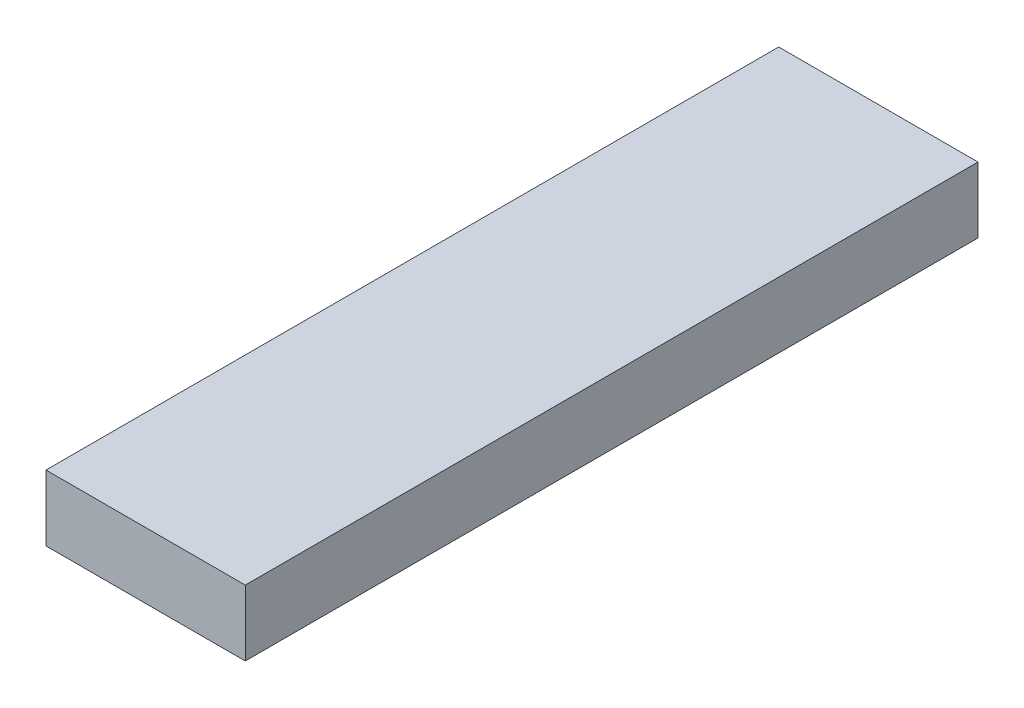
ISO-10303-21;
HEADER;
FILE_DESCRIPTION(('STEP AP214'),'2;1');
FILE_NAME('part.step','',(''),(''),'','','');
FILE_SCHEMA(('AUTOMOTIVE_DESIGN { 1 0 10303 214 1 1 1 1 }'));
ENDSEC;
DATA;
#1=APPLICATION_CONTEXT('core data for automotive mechanical design processes');
#2=APPLICATION_PROTOCOL_DEFINITION('international standard','automotive_design',2000,#1);
#3=PRODUCT_CONTEXT('',#1,'mechanical');
#4=PRODUCT('Part','Part','',(#3));
#5=PRODUCT_RELATED_PRODUCT_CATEGORY('part','',(#4));
#6=PRODUCT_DEFINITION_FORMATION('','',#4);
#7=PRODUCT_DEFINITION_CONTEXT('part definition',#1,'design');
#8=PRODUCT_DEFINITION('design','',#6,#7);
#9=PRODUCT_DEFINITION_SHAPE('','',#8);
#10=(LENGTH_UNIT() NAMED_UNIT(*) SI_UNIT(.MILLI.,.METRE.));
#11=(NAMED_UNIT(*) PLANE_ANGLE_UNIT() SI_UNIT($,.RADIAN.));
#12=(NAMED_UNIT(*) SI_UNIT($,.STERADIAN.) SOLID_ANGLE_UNIT());
#13=UNCERTAINTY_MEASURE_WITH_UNIT(LENGTH_MEASURE(1.E-05),#10,'distance_accuracy_value','');
#14=(GEOMETRIC_REPRESENTATION_CONTEXT(3) GLOBAL_UNCERTAINTY_ASSIGNED_CONTEXT((#13)) GLOBAL_UNIT_ASSIGNED_CONTEXT((#10,
#11,#12)) REPRESENTATION_CONTEXT('',''));
#15=CARTESIAN_POINT('',(0.,0.,0.));
#16=DIRECTION('',(0.,0.,1.));
#17=DIRECTION('',(1.,0.,0.));
#18=AXIS2_PLACEMENT_3D('',#15,#16,#17);
#19=CARTESIAN_POINT('',(-22.5209293511614,8.38199999999999,-44.2148189238903));
#20=DIRECTION('',(1.,0.,0.));
#21=DIRECTION('',(0.,0.,-1.));
#22=AXIS2_PLACEMENT_3D('',#19,#20,#21);
#23=PLANE('',#22);
#24=DIRECTION('',(0.,0.,1.));
#25=VECTOR('',#24,1.);
#26=CARTESIAN_POINT('',(-22.5209293511614,0.,-44.2148189238903));
#27=LINE('',#26,#25);
#28=CARTESIAN_POINT('',(-22.5209293511614,0.,-44.2148189238903));
#29=VERTEX_POINT('',#28);
#30=CARTESIAN_POINT('',(-22.5209293511614,0.,49.1770575944851));
#31=VERTEX_POINT('',#30);
#32=EDGE_CURVE('E109',#29,#31,#27,.T.);
#33=ORIENTED_EDGE('',*,*,#32,.T.);
#34=DIRECTION('',(0.,-1.,0.));
#35=VECTOR('',#34,1.);
#36=CARTESIAN_POINT('',(-22.5209293511614,8.38199999999999,49.1770575944851));
#37=LINE('',#36,#35);
#38=CARTESIAN_POINT('',(-22.5209293511614,8.38199999999999,49.1770575944851));
#39=VERTEX_POINT('',#38);
#40=EDGE_CURVE('E11',#39,#31,#37,.T.);
#41=ORIENTED_EDGE('',*,*,#40,.F.);
#42=DIRECTION('',(0.,0.,1.));
#43=VECTOR('',#42,1.);
#44=CARTESIAN_POINT('',(-22.5209293511614,8.38199999999999,-44.2148189238903));
#45=LINE('',#44,#43);
#46=CARTESIAN_POINT('',(-22.5209293511614,8.38199999999999,-44.2148189238903));
#47=VERTEX_POINT('',#46);
#48=EDGE_CURVE('E93',#47,#39,#45,.T.);
#49=ORIENTED_EDGE('',*,*,#48,.F.);
#50=DIRECTION('',(0.,-1.,0.));
#51=VECTOR('',#50,1.);
#52=CARTESIAN_POINT('',(-22.5209293511614,8.38199999999999,-44.2148189238903));
#53=LINE('',#52,#51);
#54=EDGE_CURVE('E105',#47,#29,#53,.T.);
#55=ORIENTED_EDGE('',*,*,#54,.T.);
#56=EDGE_LOOP('',(#33,#41,#49,#55));
#57=FACE_BOUND('',#56,.T.);
#58=ADVANCED_FACE('F41',(#57),#23,.F.);
#59=CARTESIAN_POINT('',(-22.5209293511614,8.38199999999999,49.1770575944851));
#60=DIRECTION('',(0.,0.,-1.));
#61=DIRECTION('',(-1.,0.,0.));
#62=AXIS2_PLACEMENT_3D('',#59,#60,#61);
#63=PLANE('',#62);
#64=DIRECTION('',(1.,0.,0.));
#65=VECTOR('',#64,1.);
#66=CARTESIAN_POINT('',(-22.5209293511614,0.,49.1770575944851));
#67=LINE('',#66,#65);
#68=CARTESIAN_POINT('',(2.87907064883863,0.,49.1770575944851));
#69=VERTEX_POINT('',#68);
#70=EDGE_CURVE('E98',#31,#69,#67,.T.);
#71=ORIENTED_EDGE('',*,*,#70,.T.);
#72=DIRECTION('',(0.,-1.,0.));
#73=VECTOR('',#72,1.);
#74=CARTESIAN_POINT('',(2.87907064883863,8.38199999999999,49.1770575944851));
#75=LINE('',#74,#73);
#76=CARTESIAN_POINT('',(2.87907064883863,8.38199999999999,49.1770575944851));
#77=VERTEX_POINT('',#76);
#78=EDGE_CURVE('E50',#77,#69,#75,.T.);
#79=ORIENTED_EDGE('',*,*,#78,.F.);
#80=DIRECTION('',(1.,0.,0.));
#81=VECTOR('',#80,1.);
#82=CARTESIAN_POINT('',(-22.5209293511614,8.38199999999999,49.1770575944851));
#83=LINE('',#82,#81);
#84=EDGE_CURVE('E88',#39,#77,#83,.T.);
#85=ORIENTED_EDGE('',*,*,#84,.F.);
#86=ORIENTED_EDGE('',*,*,#40,.T.);
#87=EDGE_LOOP('',(#71,#79,#85,#86));
#88=FACE_BOUND('',#87,.T.);
#89=ADVANCED_FACE('F97',(#88),#63,.F.);
#90=CARTESIAN_POINT('',(2.87907064883862,8.38199999999999,-44.2148189238903));
#91=DIRECTION('',(-1.,0.,0.));
#92=DIRECTION('',(0.,0.,1.));
#93=AXIS2_PLACEMENT_3D('',#90,#91,#92);
#94=PLANE('',#93);
#95=DIRECTION('',(0.,0.,-1.));
#96=VECTOR('',#95,1.);
#97=CARTESIAN_POINT('',(2.87907064883862,0.,-44.2148189238903));
#98=LINE('',#97,#96);
#99=CARTESIAN_POINT('',(2.87907064883862,0.,-44.2148189238903));
#100=VERTEX_POINT('',#99);
#101=EDGE_CURVE('E75',#69,#100,#98,.T.);
#102=ORIENTED_EDGE('',*,*,#101,.T.);
#103=DIRECTION('',(0.,-1.,0.));
#104=VECTOR('',#103,1.);
#105=CARTESIAN_POINT('',(2.87907064883862,8.38199999999999,-44.2148189238903));
#106=LINE('',#105,#104);
#107=CARTESIAN_POINT('',(2.87907064883862,8.38199999999999,-44.2148189238903));
#108=VERTEX_POINT('',#107);
#109=EDGE_CURVE('E100',#108,#100,#106,.T.);
#110=ORIENTED_EDGE('',*,*,#109,.F.);
#111=DIRECTION('',(0.,0.,-1.));
#112=VECTOR('',#111,1.);
#113=CARTESIAN_POINT('',(2.87907064883862,8.38199999999999,-44.2148189238903));
#114=LINE('',#113,#112);
#115=EDGE_CURVE('E91',#77,#108,#114,.T.);
#116=ORIENTED_EDGE('',*,*,#115,.F.);
#117=ORIENTED_EDGE('',*,*,#78,.T.);
#118=EDGE_LOOP('',(#102,#110,#116,#117));
#119=FACE_BOUND('',#118,.T.);
#120=ADVANCED_FACE('F101',(#119),#94,.F.);
#121=CARTESIAN_POINT('',(-22.5209293511614,8.38199999999999,-44.2148189238903));
#122=DIRECTION('',(0.,0.,1.));
#123=DIRECTION('',(1.,0.,0.));
#124=AXIS2_PLACEMENT_3D('',#121,#122,#123);
#125=PLANE('',#124);
#126=DIRECTION('',(-1.,0.,0.));
#127=VECTOR('',#126,1.);
#128=CARTESIAN_POINT('',(-22.5209293511614,0.,-44.2148189238903));
#129=LINE('',#128,#127);
#130=EDGE_CURVE('E81',#100,#29,#129,.T.);
#131=ORIENTED_EDGE('',*,*,#130,.T.);
#132=ORIENTED_EDGE('',*,*,#54,.F.);
#133=DIRECTION('',(-1.,0.,0.));
#134=VECTOR('',#133,1.);
#135=CARTESIAN_POINT('',(-22.5209293511614,8.38199999999999,-44.2148189238903));
#136=LINE('',#135,#134);
#137=EDGE_CURVE('E58',#108,#47,#136,.T.);
#138=ORIENTED_EDGE('',*,*,#137,.F.);
#139=ORIENTED_EDGE('',*,*,#109,.T.);
#140=EDGE_LOOP('',(#131,#132,#138,#139));
#141=FACE_BOUND('',#140,.T.);
#142=ADVANCED_FACE('F122',(#141),#125,.F.);
#143=CARTESIAN_POINT('',(0.,8.38199999999999,0.));
#144=DIRECTION('',(0.,1.,0.));
#145=DIRECTION('',(0.,0.,1.));
#146=AXIS2_PLACEMENT_3D('',#143,#144,#145);
#147=PLANE('',#146);
#148=ORIENTED_EDGE('',*,*,#48,.T.);
#149=ORIENTED_EDGE('',*,*,#84,.T.);
#150=ORIENTED_EDGE('',*,*,#115,.T.);
#151=ORIENTED_EDGE('',*,*,#137,.T.);
#152=EDGE_LOOP('',(#148,#149,#150,#151));
#153=FACE_BOUND('',#152,.T.);
#154=ADVANCED_FACE('F89',(#153),#147,.T.);
#155=CARTESIAN_POINT('',(0.,0.,0.));
#156=DIRECTION('',(0.,1.,0.));
#157=DIRECTION('',(0.,0.,1.));
#158=AXIS2_PLACEMENT_3D('',#155,#156,#157);
#159=PLANE('',#158);
#160=ORIENTED_EDGE('',*,*,#32,.F.);
#161=ORIENTED_EDGE('',*,*,#130,.F.);
#162=ORIENTED_EDGE('',*,*,#101,.F.);
#163=ORIENTED_EDGE('',*,*,#70,.F.);
#164=EDGE_LOOP('',(#160,#161,#162,#163));
#165=FACE_BOUND('',#164,.T.);
#166=ADVANCED_FACE('F125',(#165),#159,.F.);
#167=CLOSED_SHELL('',(#58,#89,#120,#142,#154,#166));
#168=MANIFOLD_SOLID_BREP('B2',#167);
#169=ADVANCED_BREP_SHAPE_REPRESENTATION('',(#18,#168),#14);
#170=SHAPE_DEFINITION_REPRESENTATION(#9,#169);
ENDSEC;
END-ISO-10303-21;
